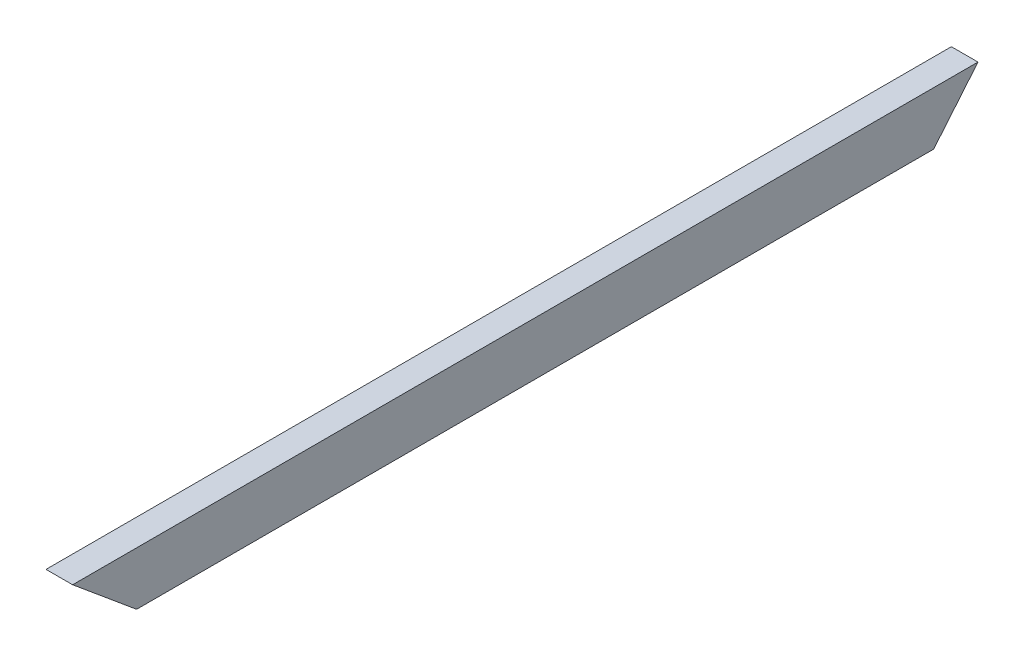
ISO-10303-21;
HEADER;
FILE_DESCRIPTION(('STEP AP214'),'2;1');
FILE_NAME('part.step','',(''),(''),'','','');
FILE_SCHEMA(('AUTOMOTIVE_DESIGN { 1 0 10303 214 1 1 1 1 }'));
ENDSEC;
DATA;
#1=APPLICATION_CONTEXT('core data for automotive mechanical design processes');
#2=APPLICATION_PROTOCOL_DEFINITION('international standard','automotive_design',2000,#1);
#3=PRODUCT_CONTEXT('',#1,'mechanical');
#4=PRODUCT('Part','Part','',(#3));
#5=PRODUCT_RELATED_PRODUCT_CATEGORY('part','',(#4));
#6=PRODUCT_DEFINITION_FORMATION('','',#4);
#7=PRODUCT_DEFINITION_CONTEXT('part definition',#1,'design');
#8=PRODUCT_DEFINITION('design','',#6,#7);
#9=PRODUCT_DEFINITION_SHAPE('','',#8);
#10=(LENGTH_UNIT() NAMED_UNIT(*) SI_UNIT(.MILLI.,.METRE.));
#11=(NAMED_UNIT(*) PLANE_ANGLE_UNIT() SI_UNIT($,.RADIAN.));
#12=(NAMED_UNIT(*) SI_UNIT($,.STERADIAN.) SOLID_ANGLE_UNIT());
#13=UNCERTAINTY_MEASURE_WITH_UNIT(LENGTH_MEASURE(1.E-05),#10,'distance_accuracy_value','');
#14=(GEOMETRIC_REPRESENTATION_CONTEXT(3) GLOBAL_UNCERTAINTY_ASSIGNED_CONTEXT((#13)) GLOBAL_UNIT_ASSIGNED_CONTEXT((#10,
#11,#12)) REPRESENTATION_CONTEXT('',''));
#15=CARTESIAN_POINT('',(0.,0.,0.));
#16=DIRECTION('',(0.,0.,1.));
#17=DIRECTION('',(1.,0.,0.));
#18=AXIS2_PLACEMENT_3D('',#15,#16,#17);
#19=CARTESIAN_POINT('',(0.,0.,431.8));
#20=DIRECTION('',(1.,0.,0.));
#21=DIRECTION('',(0.,0.,-1.));
#22=AXIS2_PLACEMENT_3D('',#19,#20,#21);
#23=PLANE('',#22);
#24=DIRECTION('',(0.,0.,-1.));
#25=VECTOR('',#24,1.);
#26=CARTESIAN_POINT('',(0.,25.4,431.8));
#27=LINE('',#26,#25);
#28=CARTESIAN_POINT('',(0.,25.4,431.8));
#29=VERTEX_POINT('',#28);
#30=CARTESIAN_POINT('',(0.,25.4,0.));
#31=VERTEX_POINT('',#30);
#32=EDGE_CURVE('E128',#29,#31,#27,.T.);
#33=ORIENTED_EDGE('',*,*,#32,.T.);
#34=DIRECTION('',(0.,-0.768684099500311,0.639628607220937));
#35=VECTOR('',#34,1.);
#36=CARTESIAN_POINT('',(0.,0.,21.1355570304798));
#37=LINE('',#36,#35);
#38=CARTESIAN_POINT('',(0.,0.,21.1355570304798));
#39=VERTEX_POINT('',#38);
#40=EDGE_CURVE('E112',#31,#39,#37,.T.);
#41=ORIENTED_EDGE('',*,*,#40,.T.);
#42=DIRECTION('',(0.,0.,-1.));
#43=VECTOR('',#42,1.);
#44=CARTESIAN_POINT('',(0.,0.,431.8));
#45=LINE('',#44,#43);
#46=CARTESIAN_POINT('',(0.,0.,401.275136185452));
#47=VERTEX_POINT('',#46);
#48=EDGE_CURVE('E126',#47,#39,#45,.T.);
#49=ORIENTED_EDGE('',*,*,#48,.F.);
#50=DIRECTION('',(0.,0.639628607220936,0.768684099500312));
#51=VECTOR('',#50,1.);
#52=CARTESIAN_POINT('',(0.,25.4,431.8));
#53=LINE('',#52,#51);
#54=EDGE_CURVE('E173',#47,#29,#53,.T.);
#55=ORIENTED_EDGE('',*,*,#54,.T.);
#56=EDGE_LOOP('',(#33,#41,#49,#55));
#57=FACE_BOUND('',#56,.T.);
#58=ADVANCED_FACE('F38',(#57),#23,.F.);
#59=CARTESIAN_POINT('',(0.,0.,431.8));
#60=DIRECTION('',(0.,1.,0.));
#61=DIRECTION('',(0.,0.,1.));
#62=AXIS2_PLACEMENT_3D('',#59,#60,#61);
#63=PLANE('',#62);
#64=ORIENTED_EDGE('',*,*,#48,.T.);
#65=DIRECTION('',(1.,0.,0.));
#66=VECTOR('',#65,1.);
#67=CARTESIAN_POINT('',(0.,0.,21.1355570304798));
#68=LINE('',#67,#66);
#69=CARTESIAN_POINT('',(12.7,0.,21.1355570304798));
#70=VERTEX_POINT('',#69);
#71=EDGE_CURVE('E109',#39,#70,#68,.T.);
#72=ORIENTED_EDGE('',*,*,#71,.T.);
#73=DIRECTION('',(0.,0.,-1.));
#74=VECTOR('',#73,1.);
#75=CARTESIAN_POINT('',(12.7,0.,431.8));
#76=LINE('',#75,#74);
#77=CARTESIAN_POINT('',(12.7,0.,401.275136185452));
#78=VERTEX_POINT('',#77);
#79=EDGE_CURVE('E135',#78,#70,#76,.T.);
#80=ORIENTED_EDGE('',*,*,#79,.F.);
#81=DIRECTION('',(1.,0.,0.));
#82=VECTOR('',#81,1.);
#83=CARTESIAN_POINT('',(0.,0.,401.275136185452));
#84=LINE('',#83,#82);
#85=EDGE_CURVE('E133',#47,#78,#84,.T.);
#86=ORIENTED_EDGE('',*,*,#85,.F.);
#87=EDGE_LOOP('',(#64,#72,#80,#86));
#88=FACE_BOUND('',#87,.T.);
#89=ADVANCED_FACE('F132',(#88),#63,.F.);
#90=CARTESIAN_POINT('',(12.7,0.,431.8));
#91=DIRECTION('',(-1.,0.,0.));
#92=DIRECTION('',(0.,0.,1.));
#93=AXIS2_PLACEMENT_3D('',#90,#91,#92);
#94=PLANE('',#93);
#95=ORIENTED_EDGE('',*,*,#79,.T.);
#96=DIRECTION('',(0.,-0.768684099500311,0.639628607220937));
#97=VECTOR('',#96,1.);
#98=CARTESIAN_POINT('',(12.7,0.,21.1355570304798));
#99=LINE('',#98,#97);
#100=CARTESIAN_POINT('',(12.7,25.4,0.));
#101=VERTEX_POINT('',#100);
#102=EDGE_CURVE('E115',#101,#70,#99,.T.);
#103=ORIENTED_EDGE('',*,*,#102,.F.);
#104=DIRECTION('',(0.,0.,-1.));
#105=VECTOR('',#104,1.);
#106=CARTESIAN_POINT('',(12.7,25.4,431.8));
#107=LINE('',#106,#105);
#108=CARTESIAN_POINT('',(12.7,25.4,431.8));
#109=VERTEX_POINT('',#108);
#110=EDGE_CURVE('E139',#109,#101,#107,.T.);
#111=ORIENTED_EDGE('',*,*,#110,.F.);
#112=DIRECTION('',(0.,0.639628607220936,0.768684099500312));
#113=VECTOR('',#112,1.);
#114=CARTESIAN_POINT('',(12.7,25.4,431.8));
#115=LINE('',#114,#113);
#116=EDGE_CURVE('E174',#78,#109,#115,.T.);
#117=ORIENTED_EDGE('',*,*,#116,.F.);
#118=EDGE_LOOP('',(#95,#103,#111,#117));
#119=FACE_BOUND('',#118,.T.);
#120=ADVANCED_FACE('F216',(#119),#94,.F.);
#121=CARTESIAN_POINT('',(0.,25.4,431.8));
#122=DIRECTION('',(0.,-1.,0.));
#123=DIRECTION('',(0.,0.,-1.));
#124=AXIS2_PLACEMENT_3D('',#121,#122,#123);
#125=PLANE('',#124);
#126=DIRECTION('',(-1.,0.,0.));
#127=VECTOR('',#126,1.);
#128=CARTESIAN_POINT('',(0.,25.4,0.));
#129=LINE('',#128,#127);
#130=EDGE_CURVE('E147',#101,#31,#129,.T.);
#131=ORIENTED_EDGE('',*,*,#130,.T.);
#132=ORIENTED_EDGE('',*,*,#32,.F.);
#133=DIRECTION('',(-1.,0.,0.));
#134=VECTOR('',#133,1.);
#135=CARTESIAN_POINT('',(0.,25.4,431.8));
#136=LINE('',#135,#134);
#137=EDGE_CURVE('E146',#109,#29,#136,.T.);
#138=ORIENTED_EDGE('',*,*,#137,.F.);
#139=ORIENTED_EDGE('',*,*,#110,.T.);
#140=EDGE_LOOP('',(#131,#132,#138,#139));
#141=FACE_BOUND('',#140,.T.);
#142=ADVANCED_FACE('F220',(#141),#125,.F.);
#143=CARTESIAN_POINT('',(3.175,3.175,431.8));
#144=DIRECTION('',(0.,1.,0.));
#145=DIRECTION('',(0.,0.,1.));
#146=AXIS2_PLACEMENT_3D('',#143,#144,#145);
#147=PLANE('',#146);
#148=DIRECTION('',(1.,0.,0.));
#149=VECTOR('',#148,1.);
#150=CARTESIAN_POINT('',(3.175,3.175,18.4936124016698));
#151=LINE('',#150,#149);
#152=CARTESIAN_POINT('',(3.175,3.17500000000004,18.4936124016697));
#153=VERTEX_POINT('',#152);
#154=CARTESIAN_POINT('',(9.525,3.17500000000004,18.4936124016697));
#155=VERTEX_POINT('',#154);
#156=EDGE_CURVE('E176',#153,#155,#151,.T.);
#157=ORIENTED_EDGE('',*,*,#156,.F.);
#158=DIRECTION('',(0.,0.,-1.));
#159=VECTOR('',#158,1.);
#160=CARTESIAN_POINT('',(3.175,3.175,431.8));
#161=LINE('',#160,#159);
#162=CARTESIAN_POINT('',(3.175,3.175,405.090744162271));
#163=VERTEX_POINT('',#162);
#164=EDGE_CURVE('E163',#163,#153,#161,.T.);
#165=ORIENTED_EDGE('',*,*,#164,.F.);
#166=DIRECTION('',(-1.,0.,0.));
#167=VECTOR('',#166,1.);
#168=CARTESIAN_POINT('',(3.175,3.175,405.090744162271));
#169=LINE('',#168,#167);
#170=CARTESIAN_POINT('',(9.525,3.175,405.090744162271));
#171=VERTEX_POINT('',#170);
#172=EDGE_CURVE('E63',#171,#163,#169,.T.);
#173=ORIENTED_EDGE('',*,*,#172,.F.);
#174=DIRECTION('',(0.,0.,-1.));
#175=VECTOR('',#174,1.);
#176=CARTESIAN_POINT('',(9.525,3.175,431.8));
#177=LINE('',#176,#175);
#178=EDGE_CURVE('E150',#171,#155,#177,.T.);
#179=ORIENTED_EDGE('',*,*,#178,.T.);
#180=EDGE_LOOP('',(#157,#165,#173,#179));
#181=FACE_BOUND('',#180,.T.);
#182=ADVANCED_FACE('F201',(#181),#147,.T.);
#183=CARTESIAN_POINT('',(9.525,3.175,431.8));
#184=DIRECTION('',(-1.,0.,0.));
#185=DIRECTION('',(0.,0.,1.));
#186=AXIS2_PLACEMENT_3D('',#183,#184,#185);
#187=PLANE('',#186);
#188=DIRECTION('',(0.,0.768684099500311,-0.639628607220937));
#189=VECTOR('',#188,1.);
#190=CARTESIAN_POINT('',(9.525,-200.036318709342,187.587487040264));
#191=LINE('',#190,#189);
#192=CARTESIAN_POINT('',(9.525,22.225,2.64194462880996));
#193=VERTEX_POINT('',#192);
#194=EDGE_CURVE('E180',#155,#193,#191,.T.);
#195=ORIENTED_EDGE('',*,*,#194,.F.);
#196=ORIENTED_EDGE('',*,*,#178,.F.);
#197=DIRECTION('',(0.,-0.639628607220936,-0.768684099500312));
#198=VECTOR('',#197,1.);
#199=CARTESIAN_POINT('',(9.525,16.3072023162268,420.872582244472));
#200=LINE('',#199,#198);
#201=CARTESIAN_POINT('',(9.525,22.225,427.984392023181));
#202=VERTEX_POINT('',#201);
#203=EDGE_CURVE('E168',#202,#171,#200,.T.);
#204=ORIENTED_EDGE('',*,*,#203,.F.);
#205=DIRECTION('',(0.,0.,-1.));
#206=VECTOR('',#205,1.);
#207=CARTESIAN_POINT('',(9.525,22.225,431.8));
#208=LINE('',#207,#206);
#209=EDGE_CURVE('E155',#202,#193,#208,.T.);
#210=ORIENTED_EDGE('',*,*,#209,.T.);
#211=EDGE_LOOP('',(#195,#196,#204,#210));
#212=FACE_BOUND('',#211,.T.);
#213=ADVANCED_FACE('F196',(#212),#187,.T.);
#214=CARTESIAN_POINT('',(3.175,22.225,431.8));
#215=DIRECTION('',(0.,-1.,0.));
#216=DIRECTION('',(0.,0.,-1.));
#217=AXIS2_PLACEMENT_3D('',#214,#215,#216);
#218=PLANE('',#217);
#219=DIRECTION('',(-1.,0.,0.));
#220=VECTOR('',#219,1.);
#221=CARTESIAN_POINT('',(3.175,22.225,2.64194462880996));
#222=LINE('',#221,#220);
#223=CARTESIAN_POINT('',(3.175,22.225,2.64194462880997));
#224=VERTEX_POINT('',#223);
#225=EDGE_CURVE('E55',#193,#224,#222,.T.);
#226=ORIENTED_EDGE('',*,*,#225,.F.);
#227=ORIENTED_EDGE('',*,*,#209,.F.);
#228=DIRECTION('',(1.,0.,0.));
#229=VECTOR('',#228,1.);
#230=CARTESIAN_POINT('',(3.175,22.225,427.984392023181));
#231=LINE('',#230,#229);
#232=CARTESIAN_POINT('',(3.175,22.225,427.984392023181));
#233=VERTEX_POINT('',#232);
#234=EDGE_CURVE('E170',#233,#202,#231,.T.);
#235=ORIENTED_EDGE('',*,*,#234,.F.);
#236=DIRECTION('',(0.,0.,-1.));
#237=VECTOR('',#236,1.);
#238=CARTESIAN_POINT('',(3.175,22.225,431.8));
#239=LINE('',#238,#237);
#240=EDGE_CURVE('E159',#233,#224,#239,.T.);
#241=ORIENTED_EDGE('',*,*,#240,.T.);
#242=EDGE_LOOP('',(#226,#227,#235,#241));
#243=FACE_BOUND('',#242,.T.);
#244=ADVANCED_FACE('F192',(#243),#218,.T.);
#245=CARTESIAN_POINT('',(3.175,3.175,431.8));
#246=DIRECTION('',(1.,0.,0.));
#247=DIRECTION('',(0.,0.,-1.));
#248=AXIS2_PLACEMENT_3D('',#245,#246,#247);
#249=PLANE('',#248);
#250=DIRECTION('',(0.,-0.768684099500311,0.639628607220937));
#251=VECTOR('',#250,1.);
#252=CARTESIAN_POINT('',(3.175,-200.036318709342,187.587487040264));
#253=LINE('',#252,#251);
#254=EDGE_CURVE('E11',#224,#153,#253,.T.);
#255=ORIENTED_EDGE('',*,*,#254,.F.);
#256=ORIENTED_EDGE('',*,*,#240,.F.);
#257=DIRECTION('',(0.,0.639628607220936,0.768684099500312));
#258=VECTOR('',#257,1.);
#259=CARTESIAN_POINT('',(3.175,16.3072023162268,420.872582244472));
#260=LINE('',#259,#258);
#261=EDGE_CURVE('E46',#163,#233,#260,.T.);
#262=ORIENTED_EDGE('',*,*,#261,.F.);
#263=ORIENTED_EDGE('',*,*,#164,.T.);
#264=EDGE_LOOP('',(#255,#256,#262,#263));
#265=FACE_BOUND('',#264,.T.);
#266=ADVANCED_FACE('F203',(#265),#249,.T.);
#267=CARTESIAN_POINT('',(0.,25.4,431.8));
#268=DIRECTION('',(0.,0.768684099500312,-0.639628607220936));
#269=DIRECTION('',(0.,0.639628607220936,0.768684099500312));
#270=AXIS2_PLACEMENT_3D('',#267,#268,#269);
#271=PLANE('',#270);
#272=ORIENTED_EDGE('',*,*,#172,.T.);
#273=ORIENTED_EDGE('',*,*,#261,.T.);
#274=ORIENTED_EDGE('',*,*,#234,.T.);
#275=ORIENTED_EDGE('',*,*,#203,.T.);
#276=EDGE_LOOP('',(#272,#273,#274,#275));
#277=FACE_BOUND('',#276,.T.);
#278=ORIENTED_EDGE('',*,*,#116,.T.);
#279=ORIENTED_EDGE('',*,*,#137,.T.);
#280=ORIENTED_EDGE('',*,*,#54,.F.);
#281=ORIENTED_EDGE('',*,*,#85,.T.);
#282=EDGE_LOOP('',(#278,#279,#280,#281));
#283=FACE_BOUND('',#282,.T.);
#284=ADVANCED_FACE('F197',(#277,#283),#271,.F.);
#285=CARTESIAN_POINT('',(0.,0.,21.1355570304798));
#286=DIRECTION('',(0.,0.639628607220937,0.768684099500311));
#287=DIRECTION('',(0.,-0.768684099500311,0.639628607220937));
#288=AXIS2_PLACEMENT_3D('',#285,#286,#287);
#289=PLANE('',#288);
#290=ORIENTED_EDGE('',*,*,#156,.T.);
#291=ORIENTED_EDGE('',*,*,#194,.T.);
#292=ORIENTED_EDGE('',*,*,#225,.T.);
#293=ORIENTED_EDGE('',*,*,#254,.T.);
#294=EDGE_LOOP('',(#290,#291,#292,#293));
#295=FACE_BOUND('',#294,.T.);
#296=ORIENTED_EDGE('',*,*,#102,.T.);
#297=ORIENTED_EDGE('',*,*,#71,.F.);
#298=ORIENTED_EDGE('',*,*,#40,.F.);
#299=ORIENTED_EDGE('',*,*,#130,.F.);
#300=EDGE_LOOP('',(#296,#297,#298,#299));
#301=FACE_BOUND('',#300,.T.);
#302=ADVANCED_FACE('F111',(#295,#301),#289,.F.);
#303=CLOSED_SHELL('',(#58,#89,#120,#142,#182,#213,#244,#266,#284,#302));
#304=MANIFOLD_SOLID_BREP('B2',#303);
#305=ADVANCED_BREP_SHAPE_REPRESENTATION('',(#18,#304),#14);
#306=SHAPE_DEFINITION_REPRESENTATION(#9,#305);
ENDSEC;
END-ISO-10303-21;
